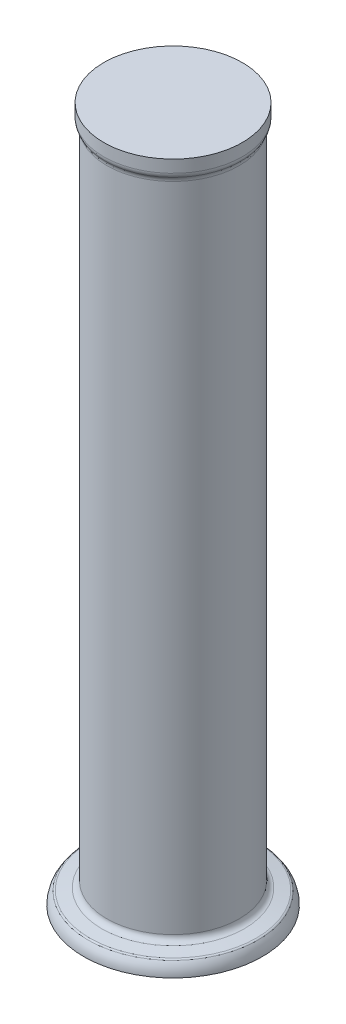
ISO-10303-21;
HEADER;
FILE_DESCRIPTION(('STEP AP214'),'2;1');
FILE_NAME('part.step','',(''),(''),'','','');
FILE_SCHEMA(('AUTOMOTIVE_DESIGN { 1 0 10303 214 1 1 1 1 }'));
ENDSEC;
DATA;
#1=APPLICATION_CONTEXT('core data for automotive mechanical design processes');
#2=APPLICATION_PROTOCOL_DEFINITION('international standard','automotive_design',2000,#1);
#3=PRODUCT_CONTEXT('',#1,'mechanical');
#4=PRODUCT('Part','Part','',(#3));
#5=PRODUCT_RELATED_PRODUCT_CATEGORY('part','',(#4));
#6=PRODUCT_DEFINITION_FORMATION('','',#4);
#7=PRODUCT_DEFINITION_CONTEXT('part definition',#1,'design');
#8=PRODUCT_DEFINITION('design','',#6,#7);
#9=PRODUCT_DEFINITION_SHAPE('','',#8);
#10=(LENGTH_UNIT() NAMED_UNIT(*) SI_UNIT(.MILLI.,.METRE.));
#11=(NAMED_UNIT(*) PLANE_ANGLE_UNIT() SI_UNIT($,.RADIAN.));
#12=(NAMED_UNIT(*) SI_UNIT($,.STERADIAN.) SOLID_ANGLE_UNIT());
#13=UNCERTAINTY_MEASURE_WITH_UNIT(LENGTH_MEASURE(1.E-05),#10,'distance_accuracy_value','');
#14=(GEOMETRIC_REPRESENTATION_CONTEXT(3) GLOBAL_UNCERTAINTY_ASSIGNED_CONTEXT((#13)) GLOBAL_UNIT_ASSIGNED_CONTEXT((#10,
#11,#12)) REPRESENTATION_CONTEXT('',''));
#15=CARTESIAN_POINT('',(0.,0.,0.));
#16=DIRECTION('',(0.,0.,1.));
#17=DIRECTION('',(1.,0.,0.));
#18=AXIS2_PLACEMENT_3D('',#15,#16,#17);
#19=CARTESIAN_POINT('',(-58.0000000000025,807.,-48.1907105375432));
#20=DIRECTION('',(0.,-1.,0.));
#21=DIRECTION('',(1.,0.,0.));
#22=AXIS2_PLACEMENT_3D('',#19,#20,#21);
#23=PLANE('',#22);
#24=CARTESIAN_POINT('',(-2.50022225145585E-12,807.,-48.1907105375428));
#25=DIRECTION('',(0.,1.,0.));
#26=DIRECTION('',(-1.,0.,0.));
#27=AXIS2_PLACEMENT_3D('',#24,#25,#26);
#28=CIRCLE('',#27,58.);
#29=CARTESIAN_POINT('',(-58.0000000000025,807.,-48.1907105375428));
#30=VERTEX_POINT('',#29);
#31=EDGE_CURVE('E35',#30,#30,#28,.T.);
#32=ORIENTED_EDGE('',*,*,#31,.F.);
#33=EDGE_LOOP('',(#32));
#34=FACE_BOUND('',#33,.T.);
#35=ADVANCED_FACE('F32',(#34),#23,.T.);
#36=CARTESIAN_POINT('',(-2.50022225145585E-12,807.,-48.1907105375428));
#37=DIRECTION('',(0.,1.,0.));
#38=DIRECTION('',(-1.,0.,0.));
#39=AXIS2_PLACEMENT_3D('',#36,#37,#38);
#40=TOROIDAL_SURFACE('',#39,45.7295895079795,12.2704104920205);
#41=CARTESIAN_POINT('',(-2.53243799590855E-12,814.875398098358,-48.1907105375428));
#42=DIRECTION('',(0.,1.,0.));
#43=DIRECTION('',(0.,0.,1.));
#44=AXIS2_PLACEMENT_3D('',#41,#42,#43);
#45=CIRCLE('',#44,55.1392164099921);
#46=CARTESIAN_POINT('',(-2.91198232714116E-12,814.875398098358,6.94850587244929));
#47=VERTEX_POINT('',#46);
#48=EDGE_CURVE('E79',#47,#47,#45,.T.);
#49=ORIENTED_EDGE('',*,*,#48,.F.);
#50=EDGE_LOOP('',(#49));
#51=FACE_BOUND('',#50,.T.);
#52=ORIENTED_EDGE('',*,*,#31,.T.);
#53=EDGE_LOOP('',(#52));
#54=FACE_BOUND('',#53,.T.);
#55=ADVANCED_FACE('F90',(#51,#54),#40,.T.);
#56=CARTESIAN_POINT('',(-45.0006854519809,1258.3,-48.1907105375429));
#57=DIRECTION('',(0.,1.,0.));
#58=DIRECTION('',(0.,0.,1.));
#59=AXIS2_PLACEMENT_3D('',#56,#57,#58);
#60=PLANE('',#59);
#61=CARTESIAN_POINT('',(-4.31946145518238E-12,1258.30000000002,-48.1907105375426));
#62=DIRECTION('',(0.,1.,0.));
#63=DIRECTION('',(-1.,0.,0.));
#64=AXIS2_PLACEMENT_3D('',#61,#62,#63);
#65=CIRCLE('',#64,45.0006854519766);
#66=CARTESIAN_POINT('',(-45.0006854519809,1258.30000000002,-48.1907105375426));
#67=VERTEX_POINT('',#66);
#68=EDGE_CURVE('E76',#67,#67,#65,.F.);
#69=ORIENTED_EDGE('',*,*,#68,.F.);
#70=EDGE_LOOP('',(#69));
#71=FACE_BOUND('',#70,.T.);
#72=ADVANCED_FACE('F87',(#71),#60,.T.);
#73=CARTESIAN_POINT('',(-2.52775578246656E-12,813.71797430624,-48.1907105375428));
#74=DIRECTION('',(0.,1.,0.));
#75=DIRECTION('',(0.,0.,1.));
#76=AXIS2_PLACEMENT_3D('',#73,#74,#75);
#77=TOROIDAL_SURFACE('',#76,53.7563115821574,1.80334566775437);
#78=CARTESIAN_POINT('',(-2.52864396088626E-12,815.493923101205,-48.1907105375428));
#79=DIRECTION('',(0.,-1.,0.));
#80=DIRECTION('',(1.,0.,0.));
#81=AXIS2_PLACEMENT_3D('',#78,#79,#80);
#82=CIRCLE('',#81,54.0694592710667);
#83=CARTESIAN_POINT('',(54.0694592710642,815.493923101206,-48.1907105375424));
#84=VERTEX_POINT('',#83);
#85=EDGE_CURVE('E73',#84,#84,#82,.F.);
#86=ORIENTED_EDGE('',*,*,#85,.F.);
#87=EDGE_LOOP('',(#86));
#88=FACE_BOUND('',#87,.T.);
#89=ORIENTED_EDGE('',*,*,#48,.T.);
#90=EDGE_LOOP('',(#89));
#91=FACE_BOUND('',#90,.T.);
#92=ADVANCED_FACE('F82',(#88,#91),#77,.T.);
#93=CARTESIAN_POINT('',(-4.31946145518225E-12,1258.29999999999,-48.1907105375426));
#94=DIRECTION('',(0.,1.,0.));
#95=DIRECTION('',(-1.,0.,0.));
#96=AXIS2_PLACEMENT_3D('',#93,#94,#95);
#97=CONICAL_SURFACE('',#96,45.0006854519766,8.56814967798771E-05);
#98=ORIENTED_EDGE('',*,*,#68,.T.);
#99=EDGE_LOOP('',(#98));
#100=FACE_BOUND('',#99,.T.);
#101=CARTESIAN_POINT('',(-4.29345274776142E-12,1250.29957159252,-48.1907105375426));
#102=DIRECTION('',(0.,1.,0.));
#103=DIRECTION('',(0.,0.,1.));
#104=AXIS2_PLACEMENT_3D('',#101,#102,#103);
#105=CIRCLE('',#104,44.9999999701759);
#106=CARTESIAN_POINT('',(-4.60320497142655E-12,1250.29957159252,-3.19071056736676));
#107=VERTEX_POINT('',#106);
#108=EDGE_CURVE('E70',#107,#107,#105,.F.);
#109=ORIENTED_EDGE('',*,*,#108,.F.);
#110=EDGE_LOOP('',(#109));
#111=FACE_BOUND('',#110,.T.);
#112=ADVANCED_FACE('F86',(#100,#111),#97,.T.);
#113=CARTESIAN_POINT('',(-2.52922682797418E-12,815.493923101205,-48.1907105375428));
#114=DIRECTION('',(0.,-1.,0.));
#115=DIRECTION('',(1.,0.,0.));
#116=AXIS2_PLACEMENT_3D('',#113,#114,#115);
#117=CONICAL_SURFACE('',#116,54.0694592710667,1.39626340159545);
#118=ORIENTED_EDGE('',*,*,#85,.T.);
#119=EDGE_LOOP('',(#118));
#120=FACE_BOUND('',#119,.T.);
#121=CARTESIAN_POINT('',(-2.54024182466655E-12,816.862934945208,-48.1907105375428));
#122=DIRECTION('',(0.,1.,0.));
#123=DIRECTION('',(-1.,0.,0.));
#124=AXIS2_PLACEMENT_3D('',#121,#122,#123);
#125=CIRCLE('',#124,46.3054072893322);
#126=CARTESIAN_POINT('',(-46.3054072893347,816.862934945208,-48.1907105375431));
#127=VERTEX_POINT('',#126);
#128=EDGE_CURVE('E68',#127,#127,#125,.F.);
#129=ORIENTED_EDGE('',*,*,#128,.T.);
#130=EDGE_LOOP('',(#129));
#131=FACE_BOUND('',#130,.T.);
#132=ADVANCED_FACE('F135',(#120,#131),#117,.T.);
#133=CARTESIAN_POINT('',(-4.29345448083041E-12,1250.3,-48.1907105375426));
#134=DIRECTION('',(0.,1.,0.));
#135=DIRECTION('',(0.,0.,1.));
#136=AXIS2_PLACEMENT_3D('',#133,#134,#135);
#137=TOROIDAL_SURFACE('',#136,40.0000000000001,4.99999998852913);
#138=ORIENTED_EDGE('',*,*,#108,.T.);
#139=EDGE_LOOP('',(#138));
#140=FACE_BOUND('',#139,.T.);
#141=CARTESIAN_POINT('',(-4.2745043615844E-12,1247.30000000138,-48.1907105375426));
#142=DIRECTION('',(0.,1.,0.));
#143=DIRECTION('',(-1.,0.,0.));
#144=AXIS2_PLACEMENT_3D('',#141,#142,#143);
#145=CIRCLE('',#144,43.9999999981647);
#146=CARTESIAN_POINT('',(-43.9999999981689,1247.30000000138,-48.190710537543));
#147=VERTEX_POINT('',#146);
#148=EDGE_CURVE('E44',#147,#147,#145,.T.);
#149=ORIENTED_EDGE('',*,*,#148,.T.);
#150=EDGE_LOOP('',(#149));
#151=FACE_BOUND('',#150,.T.);
#152=ADVANCED_FACE('F61',(#140,#151),#137,.T.);
#153=CARTESIAN_POINT('',(-2.55617749189696E-12,820.802165957257,-48.1907105375428));
#154=DIRECTION('',(0.,1.,0.));
#155=DIRECTION('',(-1.,0.,0.));
#156=AXIS2_PLACEMENT_3D('',#153,#154,#155);
#157=TOROIDAL_SURFACE('',#156,47.,4.);
#158=ORIENTED_EDGE('',*,*,#128,.F.);
#159=EDGE_LOOP('',(#158));
#160=FACE_BOUND('',#159,.T.);
#161=CARTESIAN_POINT('',(-2.5498399416421E-12,820.802165957257,-48.1907105375428));
#162=DIRECTION('',(0.,-1.,0.));
#163=DIRECTION('',(1.,0.,0.));
#164=AXIS2_PLACEMENT_3D('',#161,#162,#163);
#165=CIRCLE('',#164,43.);
#166=CARTESIAN_POINT('',(42.9999999999975,820.802165957257,-48.1907105375428));
#167=VERTEX_POINT('',#166);
#168=EDGE_CURVE('E39',#167,#167,#165,.F.);
#169=ORIENTED_EDGE('',*,*,#168,.F.);
#170=EDGE_LOOP('',(#169));
#171=FACE_BOUND('',#170,.T.);
#172=ADVANCED_FACE('F56',(#160,#171),#157,.F.);
#173=CARTESIAN_POINT('',(-4.2623682361409E-12,1244.3,-48.1907105375426));
#174=DIRECTION('',(0.,1.,0.));
#175=DIRECTION('',(-1.,0.,0.));
#176=AXIS2_PLACEMENT_3D('',#173,#174,#175);
#177=TOROIDAL_SURFACE('',#176,48.,5.00000000229416);
#178=CARTESIAN_POINT('',(-4.2630475538541E-12,1244.3,-48.1907105375426));
#179=DIRECTION('',(0.,-1.,0.));
#180=DIRECTION('',(1.,0.,0.));
#181=AXIS2_PLACEMENT_3D('',#178,#179,#180);
#182=CIRCLE('',#181,43.);
#183=CARTESIAN_POINT('',(42.9999999999957,1244.3,-48.1907105375426));
#184=VERTEX_POINT('',#183);
#185=EDGE_CURVE('E10',#184,#184,#182,.T.);
#186=ORIENTED_EDGE('',*,*,#185,.F.);
#187=EDGE_LOOP('',(#186));
#188=FACE_BOUND('',#187,.T.);
#189=ORIENTED_EDGE('',*,*,#148,.F.);
#190=EDGE_LOOP('',(#189));
#191=FACE_BOUND('',#190,.T.);
#192=ADVANCED_FACE('F51',(#188,#191),#177,.F.);
#193=CARTESIAN_POINT('',(-2.49400500251795E-12,807.,-48.1907105375428));
#194=DIRECTION('',(0.,-1.,0.));
#195=DIRECTION('',(1.,0.,0.));
#196=AXIS2_PLACEMENT_3D('',#193,#194,#195);
#197=CYLINDRICAL_SURFACE('',#196,43.);
#198=ORIENTED_EDGE('',*,*,#168,.T.);
#199=EDGE_LOOP('',(#198));
#200=FACE_BOUND('',#199,.T.);
#201=ORIENTED_EDGE('',*,*,#185,.T.);
#202=EDGE_LOOP('',(#201));
#203=FACE_BOUND('',#202,.T.);
#204=ADVANCED_FACE('F55',(#200,#203),#197,.T.);
#205=CLOSED_SHELL('',(#35,#55,#72,#92,#112,#132,#152,#172,#192,#204));
#206=MANIFOLD_SOLID_BREP('B2',#205);
#207=ADVANCED_BREP_SHAPE_REPRESENTATION('',(#18,#206),#14);
#208=SHAPE_DEFINITION_REPRESENTATION(#9,#207);
ENDSEC;
END-ISO-10303-21;
